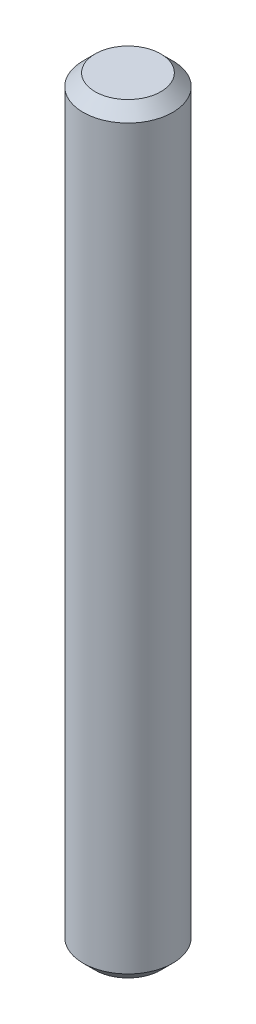
ISO-10303-21;
HEADER;
FILE_DESCRIPTION(('STEP AP214'),'2;1');
FILE_NAME('part.step','',(''),(''),'','','');
FILE_SCHEMA(('AUTOMOTIVE_DESIGN { 1 0 10303 214 1 1 1 1 }'));
ENDSEC;
DATA;
#1=APPLICATION_CONTEXT('core data for automotive mechanical design processes');
#2=APPLICATION_PROTOCOL_DEFINITION('international standard','automotive_design',2000,#1);
#3=PRODUCT_CONTEXT('',#1,'mechanical');
#4=PRODUCT('Part','Part','',(#3));
#5=PRODUCT_RELATED_PRODUCT_CATEGORY('part','',(#4));
#6=PRODUCT_DEFINITION_FORMATION('','',#4);
#7=PRODUCT_DEFINITION_CONTEXT('part definition',#1,'design');
#8=PRODUCT_DEFINITION('design','',#6,#7);
#9=PRODUCT_DEFINITION_SHAPE('','',#8);
#10=(LENGTH_UNIT() NAMED_UNIT(*) SI_UNIT(.MILLI.,.METRE.));
#11=(NAMED_UNIT(*) PLANE_ANGLE_UNIT() SI_UNIT($,.RADIAN.));
#12=(NAMED_UNIT(*) SI_UNIT($,.STERADIAN.) SOLID_ANGLE_UNIT());
#13=UNCERTAINTY_MEASURE_WITH_UNIT(LENGTH_MEASURE(1.E-05),#10,'distance_accuracy_value','');
#14=(GEOMETRIC_REPRESENTATION_CONTEXT(3) GLOBAL_UNCERTAINTY_ASSIGNED_CONTEXT((#13)) GLOBAL_UNIT_ASSIGNED_CONTEXT((#10,
#11,#12)) REPRESENTATION_CONTEXT('',''));
#15=CARTESIAN_POINT('',(0.,0.,0.));
#16=DIRECTION('',(0.,0.,1.));
#17=DIRECTION('',(1.,0.,0.));
#18=AXIS2_PLACEMENT_3D('',#15,#16,#17);
#19=CARTESIAN_POINT('',(0.,12.75,0.));
#20=DIRECTION('',(0.,-1.,0.));
#21=DIRECTION('',(0.,0.,-1.));
#22=AXIS2_PLACEMENT_3D('',#19,#20,#21);
#23=CYLINDRICAL_SURFACE('',#22,1.5);
#24=CARTESIAN_POINT('',(0.,-12.35,0.));
#25=DIRECTION('',(0.,1.,0.));
#26=DIRECTION('',(0.,0.,1.));
#27=AXIS2_PLACEMENT_3D('',#24,#25,#26);
#28=CIRCLE('',#27,1.5);
#29=CARTESIAN_POINT('',(0.,-12.35,1.5));
#30=VERTEX_POINT('',#29);
#31=EDGE_CURVE('E46',#30,#30,#28,.T.);
#32=ORIENTED_EDGE('',*,*,#31,.T.);
#33=EDGE_LOOP('',(#32));
#34=FACE_BOUND('',#33,.T.);
#35=CARTESIAN_POINT('',(0.,12.35,0.));
#36=DIRECTION('',(0.,1.,0.));
#37=DIRECTION('',(0.,0.,1.));
#38=AXIS2_PLACEMENT_3D('',#35,#36,#37);
#39=CIRCLE('',#38,1.5);
#40=CARTESIAN_POINT('',(0.,12.35,1.5));
#41=VERTEX_POINT('',#40);
#42=EDGE_CURVE('E50',#41,#41,#39,.F.);
#43=ORIENTED_EDGE('',*,*,#42,.T.);
#44=EDGE_LOOP('',(#43));
#45=FACE_BOUND('',#44,.T.);
#46=ADVANCED_FACE('F34',(#34,#45),#23,.T.);
#47=CARTESIAN_POINT('',(0.,12.75,0.));
#48=DIRECTION('',(0.,1.,0.));
#49=DIRECTION('',(0.,0.,1.));
#50=AXIS2_PLACEMENT_3D('',#47,#48,#49);
#51=PLANE('',#50);
#52=CARTESIAN_POINT('',(0.,12.75,0.));
#53=DIRECTION('',(0.,1.,0.));
#54=DIRECTION('',(0.,0.,1.));
#55=AXIS2_PLACEMENT_3D('',#52,#53,#54);
#56=CIRCLE('',#55,1.1);
#57=CARTESIAN_POINT('',(0.,12.75,1.1));
#58=VERTEX_POINT('',#57);
#59=EDGE_CURVE('E10',#58,#58,#56,.T.);
#60=ORIENTED_EDGE('',*,*,#59,.T.);
#61=EDGE_LOOP('',(#60));
#62=FACE_BOUND('',#61,.T.);
#63=ADVANCED_FACE('F66',(#62),#51,.T.);
#64=CARTESIAN_POINT('',(0.,-12.75,0.));
#65=DIRECTION('',(0.,1.,0.));
#66=DIRECTION('',(0.,0.,1.));
#67=AXIS2_PLACEMENT_3D('',#64,#65,#66);
#68=PLANE('',#67);
#69=CARTESIAN_POINT('',(0.,-12.75,0.));
#70=DIRECTION('',(0.,1.,0.));
#71=DIRECTION('',(0.,0.,1.));
#72=AXIS2_PLACEMENT_3D('',#69,#70,#71);
#73=CIRCLE('',#72,1.1);
#74=CARTESIAN_POINT('',(0.,-12.75,1.1));
#75=VERTEX_POINT('',#74);
#76=EDGE_CURVE('E42',#75,#75,#73,.F.);
#77=ORIENTED_EDGE('',*,*,#76,.T.);
#78=EDGE_LOOP('',(#77));
#79=FACE_BOUND('',#78,.T.);
#80=ADVANCED_FACE('F63',(#79),#68,.F.);
#81=CARTESIAN_POINT('',(0.,-12.35,0.));
#82=DIRECTION('',(0.,1.,0.));
#83=DIRECTION('',(0.,0.,1.));
#84=AXIS2_PLACEMENT_3D('',#81,#82,#83);
#85=CONICAL_SURFACE('',#84,1.5,0.785398163397455);
#86=ORIENTED_EDGE('',*,*,#76,.F.);
#87=EDGE_LOOP('',(#86));
#88=FACE_BOUND('',#87,.T.);
#89=ORIENTED_EDGE('',*,*,#31,.F.);
#90=EDGE_LOOP('',(#89));
#91=FACE_BOUND('',#90,.T.);
#92=ADVANCED_FACE('F59',(#88,#91),#85,.T.);
#93=CARTESIAN_POINT('',(0.,12.75,0.));
#94=DIRECTION('',(0.,-1.,0.));
#95=DIRECTION('',(0.,0.,-1.));
#96=AXIS2_PLACEMENT_3D('',#93,#94,#95);
#97=CONICAL_SURFACE('',#96,1.1,0.785398163397446);
#98=ORIENTED_EDGE('',*,*,#42,.F.);
#99=EDGE_LOOP('',(#98));
#100=FACE_BOUND('',#99,.T.);
#101=ORIENTED_EDGE('',*,*,#59,.F.);
#102=EDGE_LOOP('',(#101));
#103=FACE_BOUND('',#102,.T.);
#104=ADVANCED_FACE('F37',(#100,#103),#97,.T.);
#105=CLOSED_SHELL('',(#46,#63,#80,#92,#104));
#106=MANIFOLD_SOLID_BREP('B2',#105);
#107=ADVANCED_BREP_SHAPE_REPRESENTATION('',(#18,#106),#14);
#108=SHAPE_DEFINITION_REPRESENTATION(#9,#107);
ENDSEC;
END-ISO-10303-21;
